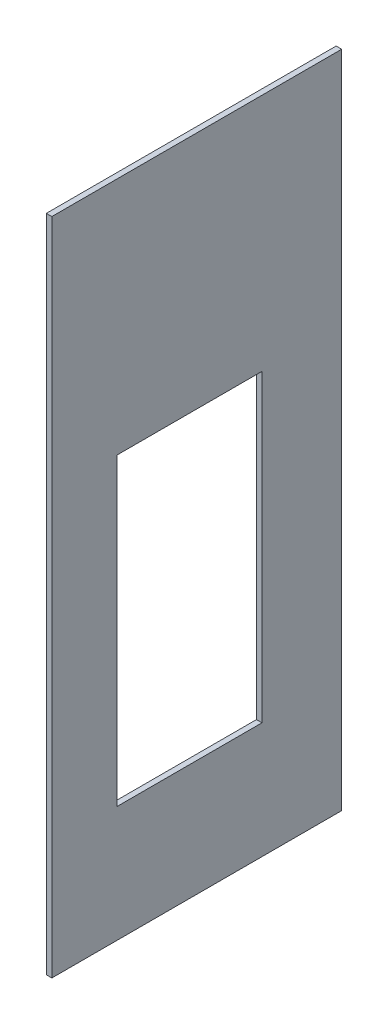
ISO-10303-21;
HEADER;
FILE_DESCRIPTION(('STEP AP214'),'2;1');
FILE_NAME('part.step','',(''),(''),'','','');
FILE_SCHEMA(('AUTOMOTIVE_DESIGN { 1 0 10303 214 1 1 1 1 }'));
ENDSEC;
DATA;
#1=APPLICATION_CONTEXT('core data for automotive mechanical design processes');
#2=APPLICATION_PROTOCOL_DEFINITION('international standard','automotive_design',2000,#1);
#3=PRODUCT_CONTEXT('',#1,'mechanical');
#4=PRODUCT('Part','Part','',(#3));
#5=PRODUCT_RELATED_PRODUCT_CATEGORY('part','',(#4));
#6=PRODUCT_DEFINITION_FORMATION('','',#4);
#7=PRODUCT_DEFINITION_CONTEXT('part definition',#1,'design');
#8=PRODUCT_DEFINITION('design','',#6,#7);
#9=PRODUCT_DEFINITION_SHAPE('','',#8);
#10=(LENGTH_UNIT() NAMED_UNIT(*) SI_UNIT(.MILLI.,.METRE.));
#11=(NAMED_UNIT(*) PLANE_ANGLE_UNIT() SI_UNIT($,.RADIAN.));
#12=(NAMED_UNIT(*) SI_UNIT($,.STERADIAN.) SOLID_ANGLE_UNIT());
#13=UNCERTAINTY_MEASURE_WITH_UNIT(LENGTH_MEASURE(1.E-05),#10,'distance_accuracy_value','');
#14=(GEOMETRIC_REPRESENTATION_CONTEXT(3) GLOBAL_UNCERTAINTY_ASSIGNED_CONTEXT((#13)) GLOBAL_UNIT_ASSIGNED_CONTEXT((#10,
#11,#12)) REPRESENTATION_CONTEXT('',''));
#15=CARTESIAN_POINT('',(0.,0.,0.));
#16=DIRECTION('',(0.,0.,1.));
#17=DIRECTION('',(1.,0.,0.));
#18=AXIS2_PLACEMENT_3D('',#15,#16,#17);
#19=CARTESIAN_POINT('',(1.21412,-72.23125,31.75));
#20=DIRECTION('',(0.,1.,0.));
#21=DIRECTION('',(0.,0.,1.));
#22=AXIS2_PLACEMENT_3D('',#19,#20,#21);
#23=PLANE('',#22);
#24=DIRECTION('',(0.,0.,-1.));
#25=VECTOR('',#24,1.);
#26=CARTESIAN_POINT('',(0.,-72.23125,31.75));
#27=LINE('',#26,#25);
#28=CARTESIAN_POINT('',(0.,-72.23125,31.75));
#29=VERTEX_POINT('',#28);
#30=CARTESIAN_POINT('',(0.,-72.23125,-31.75));
#31=VERTEX_POINT('',#30);
#32=EDGE_CURVE('E151',#29,#31,#27,.T.);
#33=ORIENTED_EDGE('',*,*,#32,.T.);
#34=DIRECTION('',(-1.,0.,0.));
#35=VECTOR('',#34,1.);
#36=CARTESIAN_POINT('',(1.21412,-72.23125,-31.75));
#37=LINE('',#36,#35);
#38=CARTESIAN_POINT('',(1.21412,-72.23125,-31.75));
#39=VERTEX_POINT('',#38);
#40=EDGE_CURVE('E11',#39,#31,#37,.T.);
#41=ORIENTED_EDGE('',*,*,#40,.F.);
#42=DIRECTION('',(0.,0.,-1.));
#43=VECTOR('',#42,1.);
#44=CARTESIAN_POINT('',(1.21412,-72.23125,31.75));
#45=LINE('',#44,#43);
#46=CARTESIAN_POINT('',(1.21412,-72.23125,31.75));
#47=VERTEX_POINT('',#46);
#48=EDGE_CURVE('E157',#47,#39,#45,.T.);
#49=ORIENTED_EDGE('',*,*,#48,.F.);
#50=DIRECTION('',(-1.,0.,0.));
#51=VECTOR('',#50,1.);
#52=CARTESIAN_POINT('',(1.21412,-72.23125,31.75));
#53=LINE('',#52,#51);
#54=EDGE_CURVE('E173',#47,#29,#53,.T.);
#55=ORIENTED_EDGE('',*,*,#54,.T.);
#56=EDGE_LOOP('',(#33,#41,#49,#55));
#57=FACE_BOUND('',#56,.T.);
#58=ADVANCED_FACE('F43',(#57),#23,.F.);
#59=CARTESIAN_POINT('',(1.21412,-72.23125,-31.75));
#60=DIRECTION('',(0.,0.,1.));
#61=DIRECTION('',(1.,0.,0.));
#62=AXIS2_PLACEMENT_3D('',#59,#60,#61);
#63=PLANE('',#62);
#64=DIRECTION('',(0.,1.,0.));
#65=VECTOR('',#64,1.);
#66=CARTESIAN_POINT('',(0.,-72.23125,-31.75));
#67=LINE('',#66,#65);
#68=CARTESIAN_POINT('',(0.,72.23125,-31.75));
#69=VERTEX_POINT('',#68);
#70=EDGE_CURVE('E177',#31,#69,#67,.T.);
#71=ORIENTED_EDGE('',*,*,#70,.T.);
#72=DIRECTION('',(-1.,0.,0.));
#73=VECTOR('',#72,1.);
#74=CARTESIAN_POINT('',(1.21412,72.23125,-31.75));
#75=LINE('',#74,#73);
#76=CARTESIAN_POINT('',(1.21412,72.23125,-31.75));
#77=VERTEX_POINT('',#76);
#78=EDGE_CURVE('E51',#77,#69,#75,.T.);
#79=ORIENTED_EDGE('',*,*,#78,.F.);
#80=DIRECTION('',(0.,1.,0.));
#81=VECTOR('',#80,1.);
#82=CARTESIAN_POINT('',(1.21412,-72.23125,-31.75));
#83=LINE('',#82,#81);
#84=EDGE_CURVE('E161',#39,#77,#83,.T.);
#85=ORIENTED_EDGE('',*,*,#84,.F.);
#86=ORIENTED_EDGE('',*,*,#40,.T.);
#87=EDGE_LOOP('',(#71,#79,#85,#86));
#88=FACE_BOUND('',#87,.T.);
#89=ADVANCED_FACE('F199',(#88),#63,.F.);
#90=CARTESIAN_POINT('',(1.21412,72.23125,31.75));
#91=DIRECTION('',(0.,1.,0.));
#92=DIRECTION('',(0.,0.,1.));
#93=AXIS2_PLACEMENT_3D('',#90,#91,#92);
#94=PLANE('',#93);
#95=DIRECTION('',(0.,0.,-1.));
#96=VECTOR('',#95,1.);
#97=CARTESIAN_POINT('',(0.,72.23125,31.75));
#98=LINE('',#97,#96);
#99=CARTESIAN_POINT('',(0.,72.23125,31.75));
#100=VERTEX_POINT('',#99);
#101=EDGE_CURVE('E181',#100,#69,#98,.T.);
#102=ORIENTED_EDGE('',*,*,#101,.F.);
#103=DIRECTION('',(-1.,0.,0.));
#104=VECTOR('',#103,1.);
#105=CARTESIAN_POINT('',(1.21412,72.23125,31.75));
#106=LINE('',#105,#104);
#107=CARTESIAN_POINT('',(1.21412,72.23125,31.75));
#108=VERTEX_POINT('',#107);
#109=EDGE_CURVE('E190',#108,#100,#106,.T.);
#110=ORIENTED_EDGE('',*,*,#109,.F.);
#111=DIRECTION('',(0.,0.,-1.));
#112=VECTOR('',#111,1.);
#113=CARTESIAN_POINT('',(1.21412,72.23125,31.75));
#114=LINE('',#113,#112);
#115=EDGE_CURVE('E165',#108,#77,#114,.T.);
#116=ORIENTED_EDGE('',*,*,#115,.T.);
#117=ORIENTED_EDGE('',*,*,#78,.T.);
#118=EDGE_LOOP('',(#102,#110,#116,#117));
#119=FACE_BOUND('',#118,.T.);
#120=ADVANCED_FACE('F196',(#119),#94,.T.);
#121=CARTESIAN_POINT('',(1.21412,-72.23125,31.75));
#122=DIRECTION('',(0.,0.,1.));
#123=DIRECTION('',(1.,0.,0.));
#124=AXIS2_PLACEMENT_3D('',#121,#122,#123);
#125=PLANE('',#124);
#126=DIRECTION('',(0.,1.,0.));
#127=VECTOR('',#126,1.);
#128=CARTESIAN_POINT('',(0.,-72.23125,31.75));
#129=LINE('',#128,#127);
#130=EDGE_CURVE('E162',#29,#100,#129,.T.);
#131=ORIENTED_EDGE('',*,*,#130,.F.);
#132=ORIENTED_EDGE('',*,*,#54,.F.);
#133=DIRECTION('',(0.,1.,0.));
#134=VECTOR('',#133,1.);
#135=CARTESIAN_POINT('',(1.21412,-72.23125,31.75));
#136=LINE('',#135,#134);
#137=EDGE_CURVE('E169',#47,#108,#136,.T.);
#138=ORIENTED_EDGE('',*,*,#137,.T.);
#139=ORIENTED_EDGE('',*,*,#109,.T.);
#140=EDGE_LOOP('',(#131,#132,#138,#139));
#141=FACE_BOUND('',#140,.T.);
#142=ADVANCED_FACE('F204',(#141),#125,.T.);
#143=CARTESIAN_POINT('',(1.21412,0.,0.));
#144=DIRECTION('',(1.,0.,0.));
#145=DIRECTION('',(0.,0.,-1.));
#146=AXIS2_PLACEMENT_3D('',#143,#144,#145);
#147=PLANE('',#146);
#148=DIRECTION('',(0.,1.,0.));
#149=VECTOR('',#148,1.);
#150=CARTESIAN_POINT('',(1.21412,-46.83125,-14.2875));
#151=LINE('',#150,#149);
#152=CARTESIAN_POINT('',(1.21412,-46.83125,-14.2875));
#153=VERTEX_POINT('',#152);
#154=CARTESIAN_POINT('',(1.21412,19.84375,-14.2875));
#155=VERTEX_POINT('',#154);
#156=EDGE_CURVE('E58',#153,#155,#151,.T.);
#157=ORIENTED_EDGE('',*,*,#156,.F.);
#158=DIRECTION('',(0.,0.,-1.));
#159=VECTOR('',#158,1.);
#160=CARTESIAN_POINT('',(1.21412,-46.83125,17.4625));
#161=LINE('',#160,#159);
#162=CARTESIAN_POINT('',(1.21412,-46.83125,17.4625));
#163=VERTEX_POINT('',#162);
#164=EDGE_CURVE('E129',#163,#153,#161,.T.);
#165=ORIENTED_EDGE('',*,*,#164,.F.);
#166=DIRECTION('',(0.,-1.,0.));
#167=VECTOR('',#166,1.);
#168=CARTESIAN_POINT('',(1.21412,-46.83125,17.4625));
#169=LINE('',#168,#167);
#170=CARTESIAN_POINT('',(1.21412,19.84375,17.4625));
#171=VERTEX_POINT('',#170);
#172=EDGE_CURVE('E133',#171,#163,#169,.T.);
#173=ORIENTED_EDGE('',*,*,#172,.F.);
#174=DIRECTION('',(0.,0.,1.));
#175=VECTOR('',#174,1.);
#176=CARTESIAN_POINT('',(1.21412,19.84375,17.4625));
#177=LINE('',#176,#175);
#178=EDGE_CURVE('E142',#155,#171,#177,.T.);
#179=ORIENTED_EDGE('',*,*,#178,.F.);
#180=EDGE_LOOP('',(#157,#165,#173,#179));
#181=FACE_BOUND('',#180,.T.);
#182=ORIENTED_EDGE('',*,*,#48,.T.);
#183=ORIENTED_EDGE('',*,*,#84,.T.);
#184=ORIENTED_EDGE('',*,*,#115,.F.);
#185=ORIENTED_EDGE('',*,*,#137,.F.);
#186=EDGE_LOOP('',(#182,#183,#184,#185));
#187=FACE_BOUND('',#186,.T.);
#188=ADVANCED_FACE('F208',(#181,#187),#147,.T.);
#189=CARTESIAN_POINT('',(0.,0.,0.));
#190=DIRECTION('',(1.,0.,0.));
#191=DIRECTION('',(0.,0.,-1.));
#192=AXIS2_PLACEMENT_3D('',#189,#190,#191);
#193=PLANE('',#192);
#194=DIRECTION('',(0.,0.,-1.));
#195=VECTOR('',#194,1.);
#196=CARTESIAN_POINT('',(0.,-46.83125,17.4625));
#197=LINE('',#196,#195);
#198=CARTESIAN_POINT('',(0.,-46.83125,17.4625));
#199=VERTEX_POINT('',#198);
#200=CARTESIAN_POINT('',(0.,-46.83125,-14.2875));
#201=VERTEX_POINT('',#200);
#202=EDGE_CURVE('E117',#199,#201,#197,.T.);
#203=ORIENTED_EDGE('',*,*,#202,.T.);
#204=DIRECTION('',(0.,1.,0.));
#205=VECTOR('',#204,1.);
#206=CARTESIAN_POINT('',(0.,-46.83125,-14.2875));
#207=LINE('',#206,#205);
#208=CARTESIAN_POINT('',(0.,19.84375,-14.2875));
#209=VERTEX_POINT('',#208);
#210=EDGE_CURVE('E110',#201,#209,#207,.T.);
#211=ORIENTED_EDGE('',*,*,#210,.T.);
#212=DIRECTION('',(0.,0.,1.));
#213=VECTOR('',#212,1.);
#214=CARTESIAN_POINT('',(0.,19.84375,17.4625));
#215=LINE('',#214,#213);
#216=CARTESIAN_POINT('',(0.,19.84375,17.4625));
#217=VERTEX_POINT('',#216);
#218=EDGE_CURVE('E120',#209,#217,#215,.T.);
#219=ORIENTED_EDGE('',*,*,#218,.T.);
#220=DIRECTION('',(0.,-1.,0.));
#221=VECTOR('',#220,1.);
#222=CARTESIAN_POINT('',(0.,-46.83125,17.4625));
#223=LINE('',#222,#221);
#224=EDGE_CURVE('E66',#217,#199,#223,.T.);
#225=ORIENTED_EDGE('',*,*,#224,.T.);
#226=EDGE_LOOP('',(#203,#211,#219,#225));
#227=FACE_BOUND('',#226,.T.);
#228=ORIENTED_EDGE('',*,*,#32,.F.);
#229=ORIENTED_EDGE('',*,*,#130,.T.);
#230=ORIENTED_EDGE('',*,*,#101,.T.);
#231=ORIENTED_EDGE('',*,*,#70,.F.);
#232=EDGE_LOOP('',(#228,#229,#230,#231));
#233=FACE_BOUND('',#232,.T.);
#234=ADVANCED_FACE('F125',(#227,#233),#193,.F.);
#235=CARTESIAN_POINT('',(0.,-46.83125,-14.2875));
#236=DIRECTION('',(0.,0.,-1.));
#237=DIRECTION('',(-1.,0.,0.));
#238=AXIS2_PLACEMENT_3D('',#235,#236,#237);
#239=PLANE('',#238);
#240=ORIENTED_EDGE('',*,*,#156,.T.);
#241=DIRECTION('',(1.,0.,0.));
#242=VECTOR('',#241,1.);
#243=CARTESIAN_POINT('',(0.,19.84375,-14.2875));
#244=LINE('',#243,#242);
#245=EDGE_CURVE('E106',#209,#155,#244,.T.);
#246=ORIENTED_EDGE('',*,*,#245,.F.);
#247=ORIENTED_EDGE('',*,*,#210,.F.);
#248=DIRECTION('',(1.,0.,0.));
#249=VECTOR('',#248,1.);
#250=CARTESIAN_POINT('',(0.,-46.83125,-14.2875));
#251=LINE('',#250,#249);
#252=EDGE_CURVE('E148',#201,#153,#251,.T.);
#253=ORIENTED_EDGE('',*,*,#252,.T.);
#254=EDGE_LOOP('',(#240,#246,#247,#253));
#255=FACE_BOUND('',#254,.T.);
#256=ADVANCED_FACE('F108',(#255),#239,.F.);
#257=CARTESIAN_POINT('',(0.,-46.83125,17.4625));
#258=DIRECTION('',(0.,-1.,0.));
#259=DIRECTION('',(0.,0.,-1.));
#260=AXIS2_PLACEMENT_3D('',#257,#258,#259);
#261=PLANE('',#260);
#262=ORIENTED_EDGE('',*,*,#164,.T.);
#263=ORIENTED_EDGE('',*,*,#252,.F.);
#264=ORIENTED_EDGE('',*,*,#202,.F.);
#265=DIRECTION('',(1.,0.,0.));
#266=VECTOR('',#265,1.);
#267=CARTESIAN_POINT('',(0.,-46.83125,17.4625));
#268=LINE('',#267,#266);
#269=EDGE_CURVE('E152',#199,#163,#268,.T.);
#270=ORIENTED_EDGE('',*,*,#269,.T.);
#271=EDGE_LOOP('',(#262,#263,#264,#270));
#272=FACE_BOUND('',#271,.T.);
#273=ADVANCED_FACE('F228',(#272),#261,.F.);
#274=CARTESIAN_POINT('',(0.,-46.83125,17.4625));
#275=DIRECTION('',(0.,0.,1.));
#276=DIRECTION('',(1.,0.,0.));
#277=AXIS2_PLACEMENT_3D('',#274,#275,#276);
#278=PLANE('',#277);
#279=ORIENTED_EDGE('',*,*,#172,.T.);
#280=ORIENTED_EDGE('',*,*,#269,.F.);
#281=ORIENTED_EDGE('',*,*,#224,.F.);
#282=DIRECTION('',(1.,0.,0.));
#283=VECTOR('',#282,1.);
#284=CARTESIAN_POINT('',(0.,19.84375,17.4625));
#285=LINE('',#284,#283);
#286=EDGE_CURVE('E116',#217,#171,#285,.T.);
#287=ORIENTED_EDGE('',*,*,#286,.T.);
#288=EDGE_LOOP('',(#279,#280,#281,#287));
#289=FACE_BOUND('',#288,.T.);
#290=ADVANCED_FACE('F231',(#289),#278,.F.);
#291=CARTESIAN_POINT('',(0.,19.84375,17.4625));
#292=DIRECTION('',(0.,1.,0.));
#293=DIRECTION('',(0.,0.,1.));
#294=AXIS2_PLACEMENT_3D('',#291,#292,#293);
#295=PLANE('',#294);
#296=ORIENTED_EDGE('',*,*,#178,.T.);
#297=ORIENTED_EDGE('',*,*,#286,.F.);
#298=ORIENTED_EDGE('',*,*,#218,.F.);
#299=ORIENTED_EDGE('',*,*,#245,.T.);
#300=EDGE_LOOP('',(#296,#297,#298,#299));
#301=FACE_BOUND('',#300,.T.);
#302=ADVANCED_FACE('F121',(#301),#295,.F.);
#303=CLOSED_SHELL('',(#58,#89,#120,#142,#188,#234,#256,#273,#290,#302));
#304=MANIFOLD_SOLID_BREP('B2',#303);
#305=ADVANCED_BREP_SHAPE_REPRESENTATION('',(#18,#304),#14);
#306=SHAPE_DEFINITION_REPRESENTATION(#9,#305);
ENDSEC;
END-ISO-10303-21;
